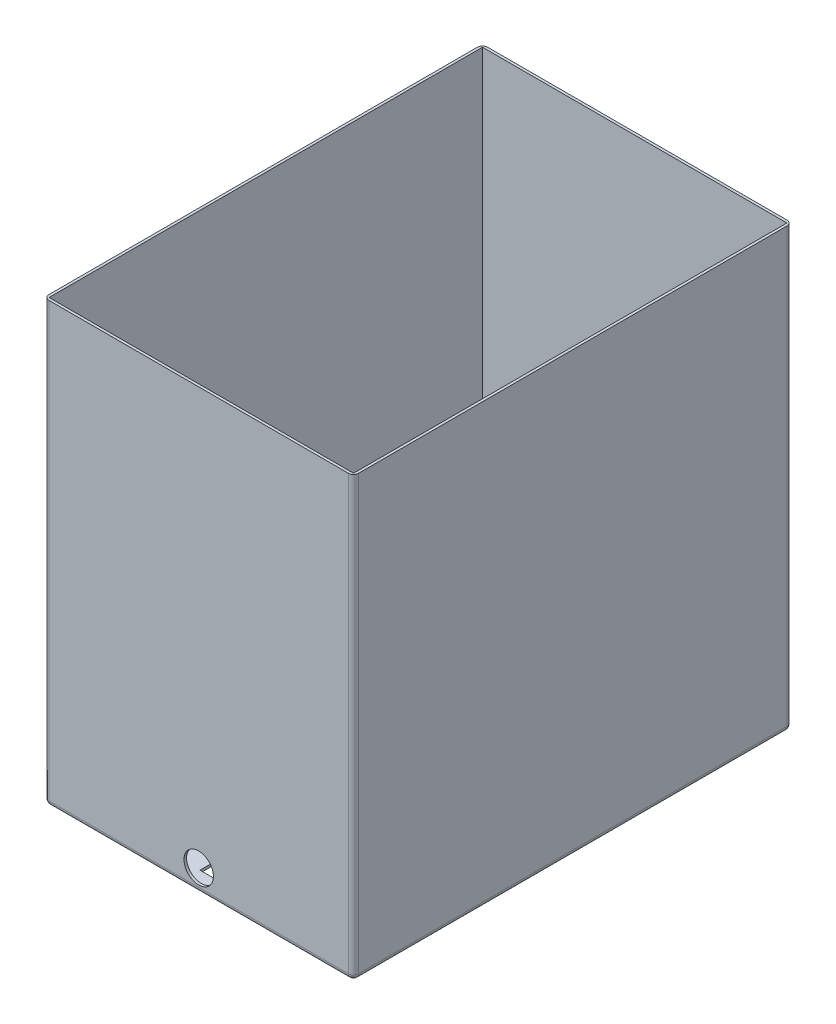
ISO-10303-21;
HEADER;
FILE_DESCRIPTION(('STEP AP214'),'2;1');
FILE_NAME('part.step','',(''),(''),'','','');
FILE_SCHEMA(('AUTOMOTIVE_DESIGN { 1 0 10303 214 1 1 1 1 }'));
ENDSEC;
DATA;
#1=APPLICATION_CONTEXT('core data for automotive mechanical design processes');
#2=APPLICATION_PROTOCOL_DEFINITION('international standard','automotive_design',2000,#1);
#3=PRODUCT_CONTEXT('',#1,'mechanical');
#4=PRODUCT('Part','Part','',(#3));
#5=PRODUCT_RELATED_PRODUCT_CATEGORY('part','',(#4));
#6=PRODUCT_DEFINITION_FORMATION('','',#4);
#7=PRODUCT_DEFINITION_CONTEXT('part definition',#1,'design');
#8=PRODUCT_DEFINITION('design','',#6,#7);
#9=PRODUCT_DEFINITION_SHAPE('','',#8);
#10=(LENGTH_UNIT() NAMED_UNIT(*) SI_UNIT(.MILLI.,.METRE.));
#11=(NAMED_UNIT(*) PLANE_ANGLE_UNIT() SI_UNIT($,.RADIAN.));
#12=(NAMED_UNIT(*) SI_UNIT($,.STERADIAN.) SOLID_ANGLE_UNIT());
#13=UNCERTAINTY_MEASURE_WITH_UNIT(LENGTH_MEASURE(1.E-05),#10,'distance_accuracy_value','');
#14=(GEOMETRIC_REPRESENTATION_CONTEXT(3) GLOBAL_UNCERTAINTY_ASSIGNED_CONTEXT((#13)) GLOBAL_UNIT_ASSIGNED_CONTEXT((#10,
#11,#12)) REPRESENTATION_CONTEXT('',''));
#15=CARTESIAN_POINT('',(0.,0.,0.));
#16=DIRECTION('',(0.,0.,1.));
#17=DIRECTION('',(1.,0.,0.));
#18=AXIS2_PLACEMENT_3D('',#15,#16,#17);
#19=CARTESIAN_POINT('',(0.,0.,431.8));
#20=DIRECTION('',(1.,0.,0.));
#21=DIRECTION('',(0.,0.,-1.));
#22=AXIS2_PLACEMENT_3D('',#19,#20,#21);
#23=PLANE('',#22);
#24=DIRECTION('',(0.,0.,-1.));
#25=VECTOR('',#24,1.);
#26=CARTESIAN_POINT('',(0.,431.8,431.8));
#27=LINE('',#26,#25);
#28=CARTESIAN_POINT('',(0.,431.8,426.72));
#29=VERTEX_POINT('',#28);
#30=CARTESIAN_POINT('',(0.,431.8,5.07999999999997));
#31=VERTEX_POINT('',#30);
#32=EDGE_CURVE('E236',#29,#31,#27,.T.);
#33=ORIENTED_EDGE('',*,*,#32,.T.);
#34=DIRECTION('',(0.,-1.,0.));
#35=VECTOR('',#34,1.);
#36=CARTESIAN_POINT('',(0.,0.,5.07999999999997));
#37=LINE('',#36,#35);
#38=CARTESIAN_POINT('',(0.,5.08,5.07999999999997));
#39=VERTEX_POINT('',#38);
#40=EDGE_CURVE('E258',#31,#39,#37,.T.);
#41=ORIENTED_EDGE('',*,*,#40,.T.);
#42=DIRECTION('',(0.,0.,-1.));
#43=VECTOR('',#42,1.);
#44=CARTESIAN_POINT('',(0.,5.08,431.8));
#45=LINE('',#44,#43);
#46=CARTESIAN_POINT('',(0.,5.08,426.72));
#47=VERTEX_POINT('',#46);
#48=EDGE_CURVE('E255',#39,#47,#45,.F.);
#49=ORIENTED_EDGE('',*,*,#48,.T.);
#50=DIRECTION('',(0.,-1.,0.));
#51=VECTOR('',#50,1.);
#52=CARTESIAN_POINT('',(0.,0.,426.72));
#53=LINE('',#52,#51);
#54=EDGE_CURVE('E253',#47,#29,#53,.F.);
#55=ORIENTED_EDGE('',*,*,#54,.T.);
#56=EDGE_LOOP('',(#33,#41,#49,#55));
#57=FACE_BOUND('',#56,.T.);
#58=ADVANCED_FACE('F38',(#57),#23,.F.);
#59=CARTESIAN_POINT('',(0.,0.,431.8));
#60=DIRECTION('',(0.,1.,0.));
#61=DIRECTION('',(0.,0.,1.));
#62=AXIS2_PLACEMENT_3D('',#59,#60,#61);
#63=PLANE('',#62);
#64=DIRECTION('',(-1.,0.,0.));
#65=VECTOR('',#64,1.);
#66=CARTESIAN_POINT('',(135.89,0.,327.914));
#67=LINE('',#66,#65);
#68=CARTESIAN_POINT('',(168.91,0.,327.914));
#69=VERTEX_POINT('',#68);
#70=CARTESIAN_POINT('',(135.89,0.,327.914));
#71=VERTEX_POINT('',#70);
#72=EDGE_CURVE('E172',#69,#71,#67,.T.);
#73=ORIENTED_EDGE('',*,*,#72,.T.);
#74=DIRECTION('',(0.,0.,1.));
#75=VECTOR('',#74,1.);
#76=CARTESIAN_POINT('',(135.89,0.,414.02));
#77=LINE('',#76,#75);
#78=CARTESIAN_POINT('',(135.89,0.,414.02));
#79=VERTEX_POINT('',#78);
#80=EDGE_CURVE('E166',#71,#79,#77,.T.);
#81=ORIENTED_EDGE('',*,*,#80,.T.);
#82=DIRECTION('',(1.,0.,0.));
#83=VECTOR('',#82,1.);
#84=CARTESIAN_POINT('',(135.89,0.,414.02));
#85=LINE('',#84,#83);
#86=CARTESIAN_POINT('',(168.91,0.,414.02));
#87=VERTEX_POINT('',#86);
#88=EDGE_CURVE('E175',#79,#87,#85,.T.);
#89=ORIENTED_EDGE('',*,*,#88,.T.);
#90=DIRECTION('',(0.,0.,-1.));
#91=VECTOR('',#90,1.);
#92=CARTESIAN_POINT('',(168.91,0.,414.02));
#93=LINE('',#92,#91);
#94=EDGE_CURVE('E55',#87,#69,#93,.T.);
#95=ORIENTED_EDGE('',*,*,#94,.T.);
#96=EDGE_LOOP('',(#73,#81,#89,#95));
#97=FACE_BOUND('',#96,.T.);
#98=DIRECTION('',(1.,0.,0.));
#99=VECTOR('',#98,1.);
#100=CARTESIAN_POINT('',(0.,0.,426.72));
#101=LINE('',#100,#99);
#102=CARTESIAN_POINT('',(299.72,0.,426.72));
#103=VERTEX_POINT('',#102);
#104=CARTESIAN_POINT('',(5.08,0.,426.72));
#105=VERTEX_POINT('',#104);
#106=EDGE_CURVE('E248',#103,#105,#101,.F.);
#107=ORIENTED_EDGE('',*,*,#106,.T.);
#108=DIRECTION('',(0.,0.,-1.));
#109=VECTOR('',#108,1.);
#110=CARTESIAN_POINT('',(5.08,0.,431.8));
#111=LINE('',#110,#109);
#112=CARTESIAN_POINT('',(5.08,0.,5.07999999999997));
#113=VERTEX_POINT('',#112);
#114=EDGE_CURVE('E250',#105,#113,#111,.T.);
#115=ORIENTED_EDGE('',*,*,#114,.T.);
#116=DIRECTION('',(1.,0.,0.));
#117=VECTOR('',#116,1.);
#118=CARTESIAN_POINT('',(304.8,0.,5.07999999999997));
#119=LINE('',#118,#117);
#120=CARTESIAN_POINT('',(299.72,0.,5.07999999999997));
#121=VERTEX_POINT('',#120);
#122=EDGE_CURVE('E244',#113,#121,#119,.T.);
#123=ORIENTED_EDGE('',*,*,#122,.T.);
#124=DIRECTION('',(0.,0.,-1.));
#125=VECTOR('',#124,1.);
#126=CARTESIAN_POINT('',(299.72,0.,431.8));
#127=LINE('',#126,#125);
#128=EDGE_CURVE('E246',#121,#103,#127,.F.);
#129=ORIENTED_EDGE('',*,*,#128,.T.);
#130=EDGE_LOOP('',(#107,#115,#123,#129));
#131=FACE_BOUND('',#130,.T.);
#132=ADVANCED_FACE('F179',(#97,#131),#63,.F.);
#133=CARTESIAN_POINT('',(304.8,0.,431.8));
#134=DIRECTION('',(-1.,0.,0.));
#135=DIRECTION('',(0.,0.,1.));
#136=AXIS2_PLACEMENT_3D('',#133,#134,#135);
#137=PLANE('',#136);
#138=DIRECTION('',(0.,0.,-1.));
#139=VECTOR('',#138,1.);
#140=CARTESIAN_POINT('',(304.8,5.08,431.8));
#141=LINE('',#140,#139);
#142=CARTESIAN_POINT('',(304.8,5.08,426.72));
#143=VERTEX_POINT('',#142);
#144=CARTESIAN_POINT('',(304.8,5.08,5.07999999999997));
#145=VERTEX_POINT('',#144);
#146=EDGE_CURVE('E268',#143,#145,#141,.T.);
#147=ORIENTED_EDGE('',*,*,#146,.T.);
#148=DIRECTION('',(0.,1.,0.));
#149=VECTOR('',#148,1.);
#150=CARTESIAN_POINT('',(304.8,431.8,5.07999999999997));
#151=LINE('',#150,#149);
#152=CARTESIAN_POINT('',(304.8,431.8,5.07999999999997));
#153=VERTEX_POINT('',#152);
#154=EDGE_CURVE('E270',#145,#153,#151,.T.);
#155=ORIENTED_EDGE('',*,*,#154,.T.);
#156=DIRECTION('',(0.,0.,-1.));
#157=VECTOR('',#156,1.);
#158=CARTESIAN_POINT('',(304.8,431.8,431.8));
#159=LINE('',#158,#157);
#160=CARTESIAN_POINT('',(304.8,431.8,426.72));
#161=VERTEX_POINT('',#160);
#162=EDGE_CURVE('E241',#161,#153,#159,.T.);
#163=ORIENTED_EDGE('',*,*,#162,.F.);
#164=DIRECTION('',(0.,1.,0.));
#165=VECTOR('',#164,1.);
#166=CARTESIAN_POINT('',(304.8,0.,426.72));
#167=LINE('',#166,#165);
#168=EDGE_CURVE('E266',#161,#143,#167,.F.);
#169=ORIENTED_EDGE('',*,*,#168,.T.);
#170=EDGE_LOOP('',(#147,#155,#163,#169));
#171=FACE_BOUND('',#170,.T.);
#172=ADVANCED_FACE('F337',(#171),#137,.F.);
#173=CARTESIAN_POINT('',(0.,431.8,431.8));
#174=DIRECTION('',(0.,-1.,0.));
#175=DIRECTION('',(0.,0.,-1.));
#176=AXIS2_PLACEMENT_3D('',#173,#174,#175);
#177=PLANE('',#176);
#178=DIRECTION('',(-1.,0.,0.));
#179=VECTOR('',#178,1.);
#180=CARTESIAN_POINT('',(302.26,431.8,2.54));
#181=LINE('',#180,#179);
#182=CARTESIAN_POINT('',(302.26,431.8,2.53999999999999));
#183=VERTEX_POINT('',#182);
#184=CARTESIAN_POINT('',(2.54,431.8,2.54));
#185=VERTEX_POINT('',#184);
#186=EDGE_CURVE('E213',#183,#185,#181,.T.);
#187=ORIENTED_EDGE('',*,*,#186,.F.);
#188=DIRECTION('',(0.,0.,-1.));
#189=VECTOR('',#188,1.);
#190=CARTESIAN_POINT('',(302.26,431.8,429.26));
#191=LINE('',#190,#189);
#192=CARTESIAN_POINT('',(302.26,431.8,429.26));
#193=VERTEX_POINT('',#192);
#194=EDGE_CURVE('E211',#193,#183,#191,.T.);
#195=ORIENTED_EDGE('',*,*,#194,.F.);
#196=DIRECTION('',(1.,0.,0.));
#197=VECTOR('',#196,1.);
#198=CARTESIAN_POINT('',(2.54,431.8,429.26));
#199=LINE('',#198,#197);
#200=CARTESIAN_POINT('',(2.54,431.8,429.26));
#201=VERTEX_POINT('',#200);
#202=EDGE_CURVE('E220',#201,#193,#199,.T.);
#203=ORIENTED_EDGE('',*,*,#202,.F.);
#204=DIRECTION('',(0.,0.,1.));
#205=VECTOR('',#204,1.);
#206=CARTESIAN_POINT('',(2.54,431.8,2.54));
#207=LINE('',#206,#205);
#208=EDGE_CURVE('E217',#185,#201,#207,.T.);
#209=ORIENTED_EDGE('',*,*,#208,.F.);
#210=EDGE_LOOP('',(#187,#195,#203,#209));
#211=FACE_BOUND('',#210,.T.);
#212=DIRECTION('',(-1.,0.,0.));
#213=VECTOR('',#212,1.);
#214=CARTESIAN_POINT('',(0.,431.8,0.));
#215=LINE('',#214,#213);
#216=CARTESIAN_POINT('',(299.72,431.8,0.));
#217=VERTEX_POINT('',#216);
#218=CARTESIAN_POINT('',(5.08,431.8,0.));
#219=VERTEX_POINT('',#218);
#220=EDGE_CURVE('E232',#217,#219,#215,.T.);
#221=ORIENTED_EDGE('',*,*,#220,.T.);
#222=CARTESIAN_POINT('',(5.08,431.8,5.07999999999997));
#223=DIRECTION('',(0.,-1.,0.));
#224=DIRECTION('',(0.,0.,-1.));
#225=AXIS2_PLACEMENT_3D('',#222,#223,#224);
#226=CIRCLE('',#225,5.08);
#227=EDGE_CURVE('E12',#219,#31,#226,.F.);
#228=ORIENTED_EDGE('',*,*,#227,.T.);
#229=ORIENTED_EDGE('',*,*,#32,.F.);
#230=CARTESIAN_POINT('',(5.08,431.8,426.72));
#231=DIRECTION('',(0.,-1.,0.));
#232=DIRECTION('',(0.,0.,-1.));
#233=AXIS2_PLACEMENT_3D('',#230,#231,#232);
#234=CIRCLE('',#233,5.08);
#235=CARTESIAN_POINT('',(5.08,431.8,431.8));
#236=VERTEX_POINT('',#235);
#237=EDGE_CURVE('E278',#29,#236,#234,.F.);
#238=ORIENTED_EDGE('',*,*,#237,.T.);
#239=DIRECTION('',(-1.,0.,0.));
#240=VECTOR('',#239,1.);
#241=CARTESIAN_POINT('',(0.,431.8,431.8));
#242=LINE('',#241,#240);
#243=CARTESIAN_POINT('',(299.72,431.8,431.8));
#244=VERTEX_POINT('',#243);
#245=EDGE_CURVE('E233',#244,#236,#242,.T.);
#246=ORIENTED_EDGE('',*,*,#245,.F.);
#247=CARTESIAN_POINT('',(299.72,431.8,426.72));
#248=DIRECTION('',(0.,-1.,0.));
#249=DIRECTION('',(0.,0.,-1.));
#250=AXIS2_PLACEMENT_3D('',#247,#248,#249);
#251=CIRCLE('',#250,5.08);
#252=EDGE_CURVE('E280',#244,#161,#251,.F.);
#253=ORIENTED_EDGE('',*,*,#252,.T.);
#254=ORIENTED_EDGE('',*,*,#162,.T.);
#255=CARTESIAN_POINT('',(299.72,431.8,5.07999999999997));
#256=DIRECTION('',(0.,-1.,0.));
#257=DIRECTION('',(0.,0.,-1.));
#258=AXIS2_PLACEMENT_3D('',#255,#256,#257);
#259=CIRCLE('',#258,5.08);
#260=EDGE_CURVE('E47',#153,#217,#259,.F.);
#261=ORIENTED_EDGE('',*,*,#260,.T.);
#262=EDGE_LOOP('',(#221,#228,#229,#238,#246,#253,#254,#261));
#263=FACE_BOUND('',#262,.T.);
#264=ADVANCED_FACE('F347',(#211,#263),#177,.F.);
#265=CARTESIAN_POINT('',(0.,0.,431.8));
#266=DIRECTION('',(0.,0.,-1.));
#267=DIRECTION('',(-1.,0.,0.));
#268=AXIS2_PLACEMENT_3D('',#265,#266,#267);
#269=PLANE('',#268);
#270=CARTESIAN_POINT('',(152.4,21.59,431.8));
#271=DIRECTION('',(0.,0.,1.));
#272=DIRECTION('',(1.,0.,0.));
#273=AXIS2_PLACEMENT_3D('',#270,#271,#272);
#274=CIRCLE('',#273,14.478);
#275=CARTESIAN_POINT('',(166.878,21.59,431.8));
#276=VERTEX_POINT('',#275);
#277=EDGE_CURVE('E188',#276,#276,#274,.T.);
#278=ORIENTED_EDGE('',*,*,#277,.F.);
#279=EDGE_LOOP('',(#278));
#280=FACE_BOUND('',#279,.T.);
#281=DIRECTION('',(1.,0.,0.));
#282=VECTOR('',#281,1.);
#283=CARTESIAN_POINT('',(0.,5.08,431.8));
#284=LINE('',#283,#282);
#285=CARTESIAN_POINT('',(5.08,5.08,431.8));
#286=VERTEX_POINT('',#285);
#287=CARTESIAN_POINT('',(299.72,5.08,431.8));
#288=VERTEX_POINT('',#287);
#289=EDGE_CURVE('E262',#286,#288,#284,.T.);
#290=ORIENTED_EDGE('',*,*,#289,.T.);
#291=DIRECTION('',(0.,1.,0.));
#292=VECTOR('',#291,1.);
#293=CARTESIAN_POINT('',(299.72,0.,431.8));
#294=LINE('',#293,#292);
#295=EDGE_CURVE('E264',#288,#244,#294,.T.);
#296=ORIENTED_EDGE('',*,*,#295,.T.);
#297=ORIENTED_EDGE('',*,*,#245,.T.);
#298=DIRECTION('',(0.,-1.,0.));
#299=VECTOR('',#298,1.);
#300=CARTESIAN_POINT('',(5.08,0.,431.8));
#301=LINE('',#300,#299);
#302=EDGE_CURVE('E260',#236,#286,#301,.T.);
#303=ORIENTED_EDGE('',*,*,#302,.T.);
#304=EDGE_LOOP('',(#290,#296,#297,#303));
#305=FACE_BOUND('',#304,.T.);
#306=ADVANCED_FACE('F375',(#280,#305),#269,.F.);
#307=CARTESIAN_POINT('',(0.,0.,0.));
#308=DIRECTION('',(0.,0.,-1.));
#309=DIRECTION('',(-1.,0.,0.));
#310=AXIS2_PLACEMENT_3D('',#307,#308,#309);
#311=PLANE('',#310);
#312=DIRECTION('',(1.,0.,0.));
#313=VECTOR('',#312,1.);
#314=CARTESIAN_POINT('',(0.,5.08,0.));
#315=LINE('',#314,#313);
#316=CARTESIAN_POINT('',(299.72,5.08,0.));
#317=VERTEX_POINT('',#316);
#318=CARTESIAN_POINT('',(5.08,5.08,0.));
#319=VERTEX_POINT('',#318);
#320=EDGE_CURVE('E274',#317,#319,#315,.F.);
#321=ORIENTED_EDGE('',*,*,#320,.T.);
#322=DIRECTION('',(0.,-1.,0.));
#323=VECTOR('',#322,1.);
#324=CARTESIAN_POINT('',(5.08,431.8,0.));
#325=LINE('',#324,#323);
#326=EDGE_CURVE('E276',#319,#219,#325,.F.);
#327=ORIENTED_EDGE('',*,*,#326,.T.);
#328=ORIENTED_EDGE('',*,*,#220,.F.);
#329=DIRECTION('',(0.,1.,0.));
#330=VECTOR('',#329,1.);
#331=CARTESIAN_POINT('',(299.72,0.,0.));
#332=LINE('',#331,#330);
#333=EDGE_CURVE('E272',#217,#317,#332,.F.);
#334=ORIENTED_EDGE('',*,*,#333,.T.);
#335=EDGE_LOOP('',(#321,#327,#328,#334));
#336=FACE_BOUND('',#335,.T.);
#337=ADVANCED_FACE('F350',(#336),#311,.T.);
#338=CARTESIAN_POINT('',(302.26,-521.461443253478,429.26));
#339=DIRECTION('',(1.,0.,0.));
#340=DIRECTION('',(0.,0.,-1.));
#341=AXIS2_PLACEMENT_3D('',#338,#339,#340);
#342=PLANE('',#341);
#343=DIRECTION('',(0.,0.,1.));
#344=VECTOR('',#343,1.);
#345=CARTESIAN_POINT('',(302.26,2.53999999999999,429.26));
#346=LINE('',#345,#344);
#347=CARTESIAN_POINT('',(302.26,2.53999999999999,2.54));
#348=VERTEX_POINT('',#347);
#349=CARTESIAN_POINT('',(302.26,2.53999999999999,429.26));
#350=VERTEX_POINT('',#349);
#351=EDGE_CURVE('E208',#348,#350,#346,.T.);
#352=ORIENTED_EDGE('',*,*,#351,.T.);
#353=DIRECTION('',(0.,1.,0.));
#354=VECTOR('',#353,1.);
#355=CARTESIAN_POINT('',(302.26,-521.461443253478,429.26));
#356=LINE('',#355,#354);
#357=EDGE_CURVE('E206',#350,#193,#356,.T.);
#358=ORIENTED_EDGE('',*,*,#357,.T.);
#359=ORIENTED_EDGE('',*,*,#194,.T.);
#360=DIRECTION('',(0.,1.,0.));
#361=VECTOR('',#360,1.);
#362=CARTESIAN_POINT('',(302.26,-521.461443253478,2.54));
#363=LINE('',#362,#361);
#364=EDGE_CURVE('E223',#348,#183,#363,.T.);
#365=ORIENTED_EDGE('',*,*,#364,.F.);
#366=EDGE_LOOP('',(#352,#358,#359,#365));
#367=FACE_BOUND('',#366,.T.);
#368=ADVANCED_FACE('F506',(#367),#342,.F.);
#369=CARTESIAN_POINT('',(2.54,-521.461443253478,429.26));
#370=DIRECTION('',(0.,0.,1.));
#371=DIRECTION('',(1.,0.,0.));
#372=AXIS2_PLACEMENT_3D('',#369,#370,#371);
#373=PLANE('',#372);
#374=CARTESIAN_POINT('',(152.4,21.59,429.26));
#375=DIRECTION('',(0.,0.,1.));
#376=DIRECTION('',(1.,0.,0.));
#377=AXIS2_PLACEMENT_3D('',#374,#375,#376);
#378=CIRCLE('',#377,14.478);
#379=CARTESIAN_POINT('',(166.878,21.59,429.26));
#380=VERTEX_POINT('',#379);
#381=EDGE_CURVE('E42',#380,#380,#378,.T.);
#382=ORIENTED_EDGE('',*,*,#381,.T.);
#383=EDGE_LOOP('',(#382));
#384=FACE_BOUND('',#383,.T.);
#385=DIRECTION('',(-1.,0.,0.));
#386=VECTOR('',#385,1.);
#387=CARTESIAN_POINT('',(2.54,2.53999999999999,429.26));
#388=LINE('',#387,#386);
#389=CARTESIAN_POINT('',(2.54,2.53999999999999,429.26));
#390=VERTEX_POINT('',#389);
#391=EDGE_CURVE('E205',#350,#390,#388,.T.);
#392=ORIENTED_EDGE('',*,*,#391,.T.);
#393=DIRECTION('',(0.,1.,0.));
#394=VECTOR('',#393,1.);
#395=CARTESIAN_POINT('',(2.54,-521.461443253478,429.26));
#396=LINE('',#395,#394);
#397=EDGE_CURVE('E225',#390,#201,#396,.T.);
#398=ORIENTED_EDGE('',*,*,#397,.T.);
#399=ORIENTED_EDGE('',*,*,#202,.T.);
#400=ORIENTED_EDGE('',*,*,#357,.F.);
#401=EDGE_LOOP('',(#392,#398,#399,#400));
#402=FACE_BOUND('',#401,.T.);
#403=ADVANCED_FACE('F500',(#384,#402),#373,.F.);
#404=CARTESIAN_POINT('',(2.54,-521.461443253478,2.54));
#405=DIRECTION('',(-1.,0.,0.));
#406=DIRECTION('',(0.,0.,1.));
#407=AXIS2_PLACEMENT_3D('',#404,#405,#406);
#408=PLANE('',#407);
#409=DIRECTION('',(0.,0.,-1.));
#410=VECTOR('',#409,1.);
#411=CARTESIAN_POINT('',(2.54,2.53999999999999,2.54));
#412=LINE('',#411,#410);
#413=CARTESIAN_POINT('',(2.54,2.53999999999999,2.54));
#414=VERTEX_POINT('',#413);
#415=EDGE_CURVE('E203',#390,#414,#412,.T.);
#416=ORIENTED_EDGE('',*,*,#415,.T.);
#417=DIRECTION('',(0.,1.,0.));
#418=VECTOR('',#417,1.);
#419=CARTESIAN_POINT('',(2.54,-521.461443253478,2.54));
#420=LINE('',#419,#418);
#421=EDGE_CURVE('E227',#414,#185,#420,.T.);
#422=ORIENTED_EDGE('',*,*,#421,.T.);
#423=ORIENTED_EDGE('',*,*,#208,.T.);
#424=ORIENTED_EDGE('',*,*,#397,.F.);
#425=EDGE_LOOP('',(#416,#422,#423,#424));
#426=FACE_BOUND('',#425,.T.);
#427=ADVANCED_FACE('F505',(#426),#408,.F.);
#428=CARTESIAN_POINT('',(302.26,-521.461443253478,2.54));
#429=DIRECTION('',(0.,0.,-1.));
#430=DIRECTION('',(-1.,0.,0.));
#431=AXIS2_PLACEMENT_3D('',#428,#429,#430);
#432=PLANE('',#431);
#433=DIRECTION('',(1.,0.,0.));
#434=VECTOR('',#433,1.);
#435=CARTESIAN_POINT('',(302.26,2.53999999999999,2.54));
#436=LINE('',#435,#434);
#437=EDGE_CURVE('E210',#414,#348,#436,.T.);
#438=ORIENTED_EDGE('',*,*,#437,.T.);
#439=ORIENTED_EDGE('',*,*,#364,.T.);
#440=ORIENTED_EDGE('',*,*,#186,.T.);
#441=ORIENTED_EDGE('',*,*,#421,.F.);
#442=EDGE_LOOP('',(#438,#439,#440,#441));
#443=FACE_BOUND('',#442,.T.);
#444=ADVANCED_FACE('F383',(#443),#432,.F.);
#445=CARTESIAN_POINT('',(0.,2.54,431.8));
#446=DIRECTION('',(0.,1.,0.));
#447=DIRECTION('',(0.,0.,1.));
#448=AXIS2_PLACEMENT_3D('',#445,#446,#447);
#449=PLANE('',#448);
#450=DIRECTION('',(0.,0.,1.));
#451=VECTOR('',#450,1.);
#452=CARTESIAN_POINT('',(135.89,2.54,414.02));
#453=LINE('',#452,#451);
#454=CARTESIAN_POINT('',(135.89,2.54,327.914));
#455=VERTEX_POINT('',#454);
#456=CARTESIAN_POINT('',(135.89,2.54,414.02));
#457=VERTEX_POINT('',#456);
#458=EDGE_CURVE('E63',#455,#457,#453,.T.);
#459=ORIENTED_EDGE('',*,*,#458,.F.);
#460=DIRECTION('',(-1.,0.,0.));
#461=VECTOR('',#460,1.);
#462=CARTESIAN_POINT('',(135.89,2.54,327.914));
#463=LINE('',#462,#461);
#464=CARTESIAN_POINT('',(168.91,2.54,327.914));
#465=VERTEX_POINT('',#464);
#466=EDGE_CURVE('E182',#465,#455,#463,.T.);
#467=ORIENTED_EDGE('',*,*,#466,.F.);
#468=DIRECTION('',(0.,0.,-1.));
#469=VECTOR('',#468,1.);
#470=CARTESIAN_POINT('',(168.91,2.54,414.02));
#471=LINE('',#470,#469);
#472=CARTESIAN_POINT('',(168.91,2.54,414.02));
#473=VERTEX_POINT('',#472);
#474=EDGE_CURVE('E185',#473,#465,#471,.T.);
#475=ORIENTED_EDGE('',*,*,#474,.F.);
#476=DIRECTION('',(1.,0.,0.));
#477=VECTOR('',#476,1.);
#478=CARTESIAN_POINT('',(135.89,2.54,414.02));
#479=LINE('',#478,#477);
#480=EDGE_CURVE('E193',#457,#473,#479,.T.);
#481=ORIENTED_EDGE('',*,*,#480,.F.);
#482=EDGE_LOOP('',(#459,#467,#475,#481));
#483=FACE_BOUND('',#482,.T.);
#484=ORIENTED_EDGE('',*,*,#351,.F.);
#485=ORIENTED_EDGE('',*,*,#437,.F.);
#486=ORIENTED_EDGE('',*,*,#415,.F.);
#487=ORIENTED_EDGE('',*,*,#391,.F.);
#488=EDGE_LOOP('',(#484,#485,#486,#487));
#489=FACE_BOUND('',#488,.T.);
#490=ADVANCED_FACE('F378',(#483,#489),#449,.T.);
#491=CARTESIAN_POINT('',(299.72,0.,426.72));
#492=DIRECTION('',(0.,1.,0.));
#493=DIRECTION('',(0.,0.,1.));
#494=AXIS2_PLACEMENT_3D('',#491,#492,#493);
#495=CYLINDRICAL_SURFACE('',#494,5.08);
#496=ORIENTED_EDGE('',*,*,#252,.F.);
#497=ORIENTED_EDGE('',*,*,#295,.F.);
#498=CARTESIAN_POINT('',(299.72,5.08,426.72));
#499=DIRECTION('',(0.,-1.,0.));
#500=DIRECTION('',(0.,0.,-1.));
#501=AXIS2_PLACEMENT_3D('',#498,#499,#500);
#502=CIRCLE('',#501,5.08);
#503=EDGE_CURVE('E214',#143,#288,#502,.T.);
#504=ORIENTED_EDGE('',*,*,#503,.F.);
#505=ORIENTED_EDGE('',*,*,#168,.F.);
#506=EDGE_LOOP('',(#496,#497,#504,#505));
#507=FACE_BOUND('',#506,.T.);
#508=ADVANCED_FACE('F40',(#507),#495,.T.);
#509=CARTESIAN_POINT('',(299.72,5.08,431.8));
#510=DIRECTION('',(0.,0.,-1.));
#511=DIRECTION('',(-1.,0.,0.));
#512=AXIS2_PLACEMENT_3D('',#509,#510,#511);
#513=CYLINDRICAL_SURFACE('',#512,5.08);
#514=CARTESIAN_POINT('',(299.72,5.08,5.07999999999997));
#515=DIRECTION('',(0.,0.,-1.));
#516=DIRECTION('',(-1.,0.,0.));
#517=AXIS2_PLACEMENT_3D('',#514,#515,#516);
#518=CIRCLE('',#517,5.08);
#519=EDGE_CURVE('E307',#145,#121,#518,.T.);
#520=ORIENTED_EDGE('',*,*,#519,.F.);
#521=ORIENTED_EDGE('',*,*,#146,.F.);
#522=CARTESIAN_POINT('',(299.72,5.08,426.72));
#523=DIRECTION('',(0.,0.,1.));
#524=DIRECTION('',(1.,0.,0.));
#525=AXIS2_PLACEMENT_3D('',#522,#523,#524);
#526=CIRCLE('',#525,5.08);
#527=EDGE_CURVE('E310',#103,#143,#526,.T.);
#528=ORIENTED_EDGE('',*,*,#527,.F.);
#529=ORIENTED_EDGE('',*,*,#128,.F.);
#530=EDGE_LOOP('',(#520,#521,#528,#529));
#531=FACE_BOUND('',#530,.T.);
#532=ADVANCED_FACE('F334',(#531),#513,.T.);
#533=CARTESIAN_POINT('',(299.72,0.,5.07999999999997));
#534=DIRECTION('',(0.,-1.,0.));
#535=DIRECTION('',(0.,0.,-1.));
#536=AXIS2_PLACEMENT_3D('',#533,#534,#535);
#537=CYLINDRICAL_SURFACE('',#536,5.08);
#538=ORIENTED_EDGE('',*,*,#260,.F.);
#539=ORIENTED_EDGE('',*,*,#154,.F.);
#540=CARTESIAN_POINT('',(299.72,5.08,5.08));
#541=DIRECTION('',(0.,-1.,0.));
#542=DIRECTION('',(0.,0.,-1.));
#543=AXIS2_PLACEMENT_3D('',#540,#541,#542);
#544=CIRCLE('',#543,5.08);
#545=EDGE_CURVE('E304',#317,#145,#544,.T.);
#546=ORIENTED_EDGE('',*,*,#545,.F.);
#547=ORIENTED_EDGE('',*,*,#333,.F.);
#548=EDGE_LOOP('',(#538,#539,#546,#547));
#549=FACE_BOUND('',#548,.T.);
#550=ADVANCED_FACE('F342',(#549),#537,.T.);
#551=CARTESIAN_POINT('',(299.72,5.08,426.72));
#552=DIRECTION('',(1.,0.,0.));
#553=DIRECTION('',(0.,0.,-1.));
#554=AXIS2_PLACEMENT_3D('',#551,#552,#553);
#555=SPHERICAL_SURFACE('',#554,5.08);
#556=ORIENTED_EDGE('',*,*,#527,.T.);
#557=ORIENTED_EDGE('',*,*,#503,.T.);
#558=CARTESIAN_POINT('',(299.72,5.08,426.72));
#559=DIRECTION('',(1.,0.,0.));
#560=DIRECTION('',(0.,0.,-1.));
#561=AXIS2_PLACEMENT_3D('',#558,#559,#560);
#562=CIRCLE('',#561,5.08);
#563=EDGE_CURVE('E301',#103,#288,#562,.F.);
#564=ORIENTED_EDGE('',*,*,#563,.F.);
#565=EDGE_LOOP('',(#556,#557,#564));
#566=FACE_BOUND('',#565,.T.);
#567=ADVANCED_FACE('F316',(#566),#555,.T.);
#568=CARTESIAN_POINT('',(299.72,5.08,5.08));
#569=DIRECTION('',(1.,0.,0.));
#570=DIRECTION('',(0.,0.,-1.));
#571=AXIS2_PLACEMENT_3D('',#568,#569,#570);
#572=SPHERICAL_SURFACE('',#571,5.08);
#573=ORIENTED_EDGE('',*,*,#545,.T.);
#574=ORIENTED_EDGE('',*,*,#519,.T.);
#575=CARTESIAN_POINT('',(299.72,5.08,5.07999999999997));
#576=DIRECTION('',(1.,0.,0.));
#577=DIRECTION('',(0.,0.,-1.));
#578=AXIS2_PLACEMENT_3D('',#575,#576,#577);
#579=CIRCLE('',#578,5.08);
#580=EDGE_CURVE('E298',#317,#121,#579,.F.);
#581=ORIENTED_EDGE('',*,*,#580,.F.);
#582=EDGE_LOOP('',(#573,#574,#581));
#583=FACE_BOUND('',#582,.T.);
#584=ADVANCED_FACE('F410',(#583),#572,.T.);
#585=CARTESIAN_POINT('',(5.08,0.,426.72));
#586=DIRECTION('',(0.,-1.,0.));
#587=DIRECTION('',(0.,0.,-1.));
#588=AXIS2_PLACEMENT_3D('',#585,#586,#587);
#589=CYLINDRICAL_SURFACE('',#588,5.08);
#590=ORIENTED_EDGE('',*,*,#237,.F.);
#591=ORIENTED_EDGE('',*,*,#54,.F.);
#592=CARTESIAN_POINT('',(5.08,5.08,426.72));
#593=DIRECTION('',(0.,-1.,0.));
#594=DIRECTION('',(0.,0.,-1.));
#595=AXIS2_PLACEMENT_3D('',#592,#593,#594);
#596=CIRCLE('',#595,5.08);
#597=EDGE_CURVE('E295',#286,#47,#596,.T.);
#598=ORIENTED_EDGE('',*,*,#597,.F.);
#599=ORIENTED_EDGE('',*,*,#302,.F.);
#600=EDGE_LOOP('',(#590,#591,#598,#599));
#601=FACE_BOUND('',#600,.T.);
#602=ADVANCED_FACE('F373',(#601),#589,.T.);
#603=CARTESIAN_POINT('',(0.,5.08,426.72));
#604=DIRECTION('',(1.,0.,0.));
#605=DIRECTION('',(0.,0.,-1.));
#606=AXIS2_PLACEMENT_3D('',#603,#604,#605);
#607=CYLINDRICAL_SURFACE('',#606,5.08);
#608=ORIENTED_EDGE('',*,*,#563,.T.);
#609=ORIENTED_EDGE('',*,*,#289,.F.);
#610=CARTESIAN_POINT('',(5.08,5.08,426.72));
#611=DIRECTION('',(-1.,0.,0.));
#612=DIRECTION('',(0.,0.,1.));
#613=AXIS2_PLACEMENT_3D('',#610,#611,#612);
#614=CIRCLE('',#613,5.08);
#615=EDGE_CURVE('E292',#105,#286,#614,.T.);
#616=ORIENTED_EDGE('',*,*,#615,.F.);
#617=ORIENTED_EDGE('',*,*,#106,.F.);
#618=EDGE_LOOP('',(#608,#609,#616,#617));
#619=FACE_BOUND('',#618,.T.);
#620=ADVANCED_FACE('F324',(#619),#607,.T.);
#621=CARTESIAN_POINT('',(0.,5.08,5.07999999999997));
#622=DIRECTION('',(-1.,0.,0.));
#623=DIRECTION('',(0.,0.,1.));
#624=AXIS2_PLACEMENT_3D('',#621,#622,#623);
#625=CYLINDRICAL_SURFACE('',#624,5.08);
#626=ORIENTED_EDGE('',*,*,#580,.T.);
#627=ORIENTED_EDGE('',*,*,#122,.F.);
#628=CARTESIAN_POINT('',(5.08,5.08,5.08));
#629=DIRECTION('',(-1.,0.,0.));
#630=DIRECTION('',(0.,0.,1.));
#631=AXIS2_PLACEMENT_3D('',#628,#629,#630);
#632=CIRCLE('',#631,5.08);
#633=EDGE_CURVE('E289',#319,#113,#632,.T.);
#634=ORIENTED_EDGE('',*,*,#633,.F.);
#635=ORIENTED_EDGE('',*,*,#320,.F.);
#636=EDGE_LOOP('',(#626,#627,#634,#635));
#637=FACE_BOUND('',#636,.T.);
#638=ADVANCED_FACE('F360',(#637),#625,.T.);
#639=CARTESIAN_POINT('',(5.08,0.,5.07999999999997));
#640=DIRECTION('',(0.,1.,0.));
#641=DIRECTION('',(0.,0.,1.));
#642=AXIS2_PLACEMENT_3D('',#639,#640,#641);
#643=CYLINDRICAL_SURFACE('',#642,5.08);
#644=ORIENTED_EDGE('',*,*,#227,.F.);
#645=ORIENTED_EDGE('',*,*,#326,.F.);
#646=CARTESIAN_POINT('',(5.08,5.08,5.07999999999997));
#647=DIRECTION('',(0.,-1.,0.));
#648=DIRECTION('',(0.,0.,-1.));
#649=AXIS2_PLACEMENT_3D('',#646,#647,#648);
#650=CIRCLE('',#649,5.08);
#651=EDGE_CURVE('E286',#39,#319,#650,.T.);
#652=ORIENTED_EDGE('',*,*,#651,.F.);
#653=ORIENTED_EDGE('',*,*,#40,.F.);
#654=EDGE_LOOP('',(#644,#645,#652,#653));
#655=FACE_BOUND('',#654,.T.);
#656=ADVANCED_FACE('F356',(#655),#643,.T.);
#657=CARTESIAN_POINT('',(5.08,5.08,426.72));
#658=DIRECTION('',(0.,0.,1.));
#659=DIRECTION('',(1.,0.,0.));
#660=AXIS2_PLACEMENT_3D('',#657,#658,#659);
#661=SPHERICAL_SURFACE('',#660,5.08);
#662=ORIENTED_EDGE('',*,*,#615,.T.);
#663=ORIENTED_EDGE('',*,*,#597,.T.);
#664=CARTESIAN_POINT('',(5.08,5.08,426.72));
#665=DIRECTION('',(0.,0.,1.));
#666=DIRECTION('',(1.,0.,0.));
#667=AXIS2_PLACEMENT_3D('',#664,#665,#666);
#668=CIRCLE('',#667,5.08);
#669=EDGE_CURVE('E284',#105,#47,#668,.F.);
#670=ORIENTED_EDGE('',*,*,#669,.F.);
#671=EDGE_LOOP('',(#662,#663,#670));
#672=FACE_BOUND('',#671,.T.);
#673=ADVANCED_FACE('F398',(#672),#661,.T.);
#674=CARTESIAN_POINT('',(5.08,5.08,5.08));
#675=DIRECTION('',(0.,0.,-1.));
#676=DIRECTION('',(-1.,0.,0.));
#677=AXIS2_PLACEMENT_3D('',#674,#675,#676);
#678=SPHERICAL_SURFACE('',#677,5.08);
#679=ORIENTED_EDGE('',*,*,#651,.T.);
#680=ORIENTED_EDGE('',*,*,#633,.T.);
#681=CARTESIAN_POINT('',(5.08,5.08,5.07999999999997));
#682=DIRECTION('',(0.,0.,-1.));
#683=DIRECTION('',(-1.,0.,0.));
#684=AXIS2_PLACEMENT_3D('',#681,#682,#683);
#685=CIRCLE('',#684,5.08);
#686=EDGE_CURVE('E199',#39,#113,#685,.F.);
#687=ORIENTED_EDGE('',*,*,#686,.F.);
#688=EDGE_LOOP('',(#679,#680,#687));
#689=FACE_BOUND('',#688,.T.);
#690=ADVANCED_FACE('F363',(#689),#678,.T.);
#691=CARTESIAN_POINT('',(5.08,5.08,431.8));
#692=DIRECTION('',(0.,0.,-1.));
#693=DIRECTION('',(-1.,0.,0.));
#694=AXIS2_PLACEMENT_3D('',#691,#692,#693);
#695=CYLINDRICAL_SURFACE('',#694,5.08);
#696=ORIENTED_EDGE('',*,*,#669,.T.);
#697=ORIENTED_EDGE('',*,*,#48,.F.);
#698=ORIENTED_EDGE('',*,*,#686,.T.);
#699=ORIENTED_EDGE('',*,*,#114,.F.);
#700=EDGE_LOOP('',(#696,#697,#698,#699));
#701=FACE_BOUND('',#700,.T.);
#702=ADVANCED_FACE('F365',(#701),#695,.T.);
#703=CARTESIAN_POINT('',(135.89,0.,414.02));
#704=DIRECTION('',(-1.,0.,0.));
#705=DIRECTION('',(0.,0.,1.));
#706=AXIS2_PLACEMENT_3D('',#703,#704,#705);
#707=PLANE('',#706);
#708=ORIENTED_EDGE('',*,*,#458,.T.);
#709=DIRECTION('',(0.,1.,0.));
#710=VECTOR('',#709,1.);
#711=CARTESIAN_POINT('',(135.89,0.,414.02));
#712=LINE('',#711,#710);
#713=EDGE_CURVE('E162',#79,#457,#712,.T.);
#714=ORIENTED_EDGE('',*,*,#713,.F.);
#715=ORIENTED_EDGE('',*,*,#80,.F.);
#716=DIRECTION('',(0.,1.,0.));
#717=VECTOR('',#716,1.);
#718=CARTESIAN_POINT('',(135.89,0.,327.914));
#719=LINE('',#718,#717);
#720=EDGE_CURVE('E197',#71,#455,#719,.T.);
#721=ORIENTED_EDGE('',*,*,#720,.T.);
#722=EDGE_LOOP('',(#708,#714,#715,#721));
#723=FACE_BOUND('',#722,.T.);
#724=ADVANCED_FACE('F164',(#723),#707,.F.);
#725=CARTESIAN_POINT('',(135.89,0.,327.914));
#726=DIRECTION('',(0.,0.,-1.));
#727=DIRECTION('',(-1.,0.,0.));
#728=AXIS2_PLACEMENT_3D('',#725,#726,#727);
#729=PLANE('',#728);
#730=ORIENTED_EDGE('',*,*,#466,.T.);
#731=ORIENTED_EDGE('',*,*,#720,.F.);
#732=ORIENTED_EDGE('',*,*,#72,.F.);
#733=DIRECTION('',(0.,1.,0.));
#734=VECTOR('',#733,1.);
#735=CARTESIAN_POINT('',(168.91,0.,327.914));
#736=LINE('',#735,#734);
#737=EDGE_CURVE('E200',#69,#465,#736,.T.);
#738=ORIENTED_EDGE('',*,*,#737,.T.);
#739=EDGE_LOOP('',(#730,#731,#732,#738));
#740=FACE_BOUND('',#739,.T.);
#741=ADVANCED_FACE('F464',(#740),#729,.F.);
#742=CARTESIAN_POINT('',(168.91,0.,414.02));
#743=DIRECTION('',(1.,0.,0.));
#744=DIRECTION('',(0.,0.,-1.));
#745=AXIS2_PLACEMENT_3D('',#742,#743,#744);
#746=PLANE('',#745);
#747=ORIENTED_EDGE('',*,*,#474,.T.);
#748=ORIENTED_EDGE('',*,*,#737,.F.);
#749=ORIENTED_EDGE('',*,*,#94,.F.);
#750=DIRECTION('',(0.,1.,0.));
#751=VECTOR('',#750,1.);
#752=CARTESIAN_POINT('',(168.91,0.,414.02));
#753=LINE('',#752,#751);
#754=EDGE_CURVE('E171',#87,#473,#753,.T.);
#755=ORIENTED_EDGE('',*,*,#754,.T.);
#756=EDGE_LOOP('',(#747,#748,#749,#755));
#757=FACE_BOUND('',#756,.T.);
#758=ADVANCED_FACE('F472',(#757),#746,.F.);
#759=CARTESIAN_POINT('',(135.89,0.,414.02));
#760=DIRECTION('',(0.,0.,1.));
#761=DIRECTION('',(1.,0.,0.));
#762=AXIS2_PLACEMENT_3D('',#759,#760,#761);
#763=PLANE('',#762);
#764=ORIENTED_EDGE('',*,*,#480,.T.);
#765=ORIENTED_EDGE('',*,*,#754,.F.);
#766=ORIENTED_EDGE('',*,*,#88,.F.);
#767=ORIENTED_EDGE('',*,*,#713,.T.);
#768=EDGE_LOOP('',(#764,#765,#766,#767));
#769=FACE_BOUND('',#768,.T.);
#770=ADVANCED_FACE('F176',(#769),#763,.F.);
#771=CARTESIAN_POINT('',(152.4,21.59,424.18));
#772=DIRECTION('',(0.,0.,1.));
#773=DIRECTION('',(1.,0.,0.));
#774=AXIS2_PLACEMENT_3D('',#771,#772,#773);
#775=CYLINDRICAL_SURFACE('',#774,14.478);
#776=ORIENTED_EDGE('',*,*,#277,.T.);
#777=EDGE_LOOP('',(#776));
#778=FACE_BOUND('',#777,.T.);
#779=ORIENTED_EDGE('',*,*,#381,.F.);
#780=EDGE_LOOP('',(#779));
#781=FACE_BOUND('',#780,.T.);
#782=ADVANCED_FACE('F486',(#778,#781),#775,.F.);
#783=CLOSED_SHELL('',(#58,#132,#172,#264,#306,#337,#368,#403,#427,#444,#490,#508,#532,#550,#567,
#584,#602,#620,#638,#656,#673,#690,#702,#724,#741,#758,#770,#782));
#784=MANIFOLD_SOLID_BREP('B2',#783);
#785=ADVANCED_BREP_SHAPE_REPRESENTATION('',(#18,#784),#14);
#786=SHAPE_DEFINITION_REPRESENTATION(#9,#785);
ENDSEC;
END-ISO-10303-21;
